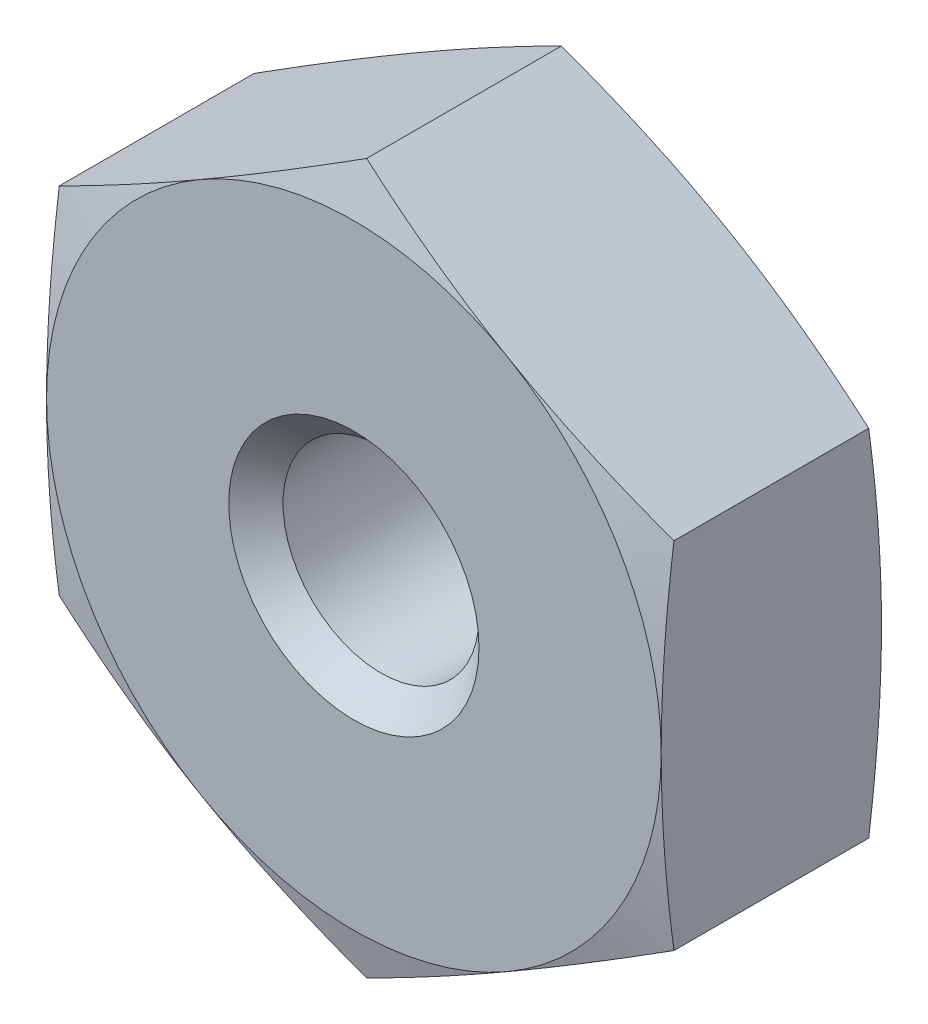
ISO-10303-21;
HEADER;
FILE_DESCRIPTION(('STEP AP214'),'2;1');
FILE_NAME('part.step','',(''),(''),'','','');
FILE_SCHEMA(('AUTOMOTIVE_DESIGN { 1 0 10303 214 1 1 1 1 }'));
ENDSEC;
DATA;
#1=APPLICATION_CONTEXT('core data for automotive mechanical design processes');
#2=APPLICATION_PROTOCOL_DEFINITION('international standard','automotive_design',2000,#1);
#3=PRODUCT_CONTEXT('',#1,'mechanical');
#4=PRODUCT('Part','Part','',(#3));
#5=PRODUCT_RELATED_PRODUCT_CATEGORY('part','',(#4));
#6=PRODUCT_DEFINITION_FORMATION('','',#4);
#7=PRODUCT_DEFINITION_CONTEXT('part definition',#1,'design');
#8=PRODUCT_DEFINITION('design','',#6,#7);
#9=PRODUCT_DEFINITION_SHAPE('','',#8);
#10=(LENGTH_UNIT() NAMED_UNIT(*) SI_UNIT(.MILLI.,.METRE.));
#11=(NAMED_UNIT(*) PLANE_ANGLE_UNIT() SI_UNIT($,.RADIAN.));
#12=(NAMED_UNIT(*) SI_UNIT($,.STERADIAN.) SOLID_ANGLE_UNIT());
#13=UNCERTAINTY_MEASURE_WITH_UNIT(LENGTH_MEASURE(1.E-05),#10,'distance_accuracy_value','');
#14=(GEOMETRIC_REPRESENTATION_CONTEXT(3) GLOBAL_UNCERTAINTY_ASSIGNED_CONTEXT((#13)) GLOBAL_UNIT_ASSIGNED_CONTEXT((#10,
#11,#12)) REPRESENTATION_CONTEXT('',''));
#15=CARTESIAN_POINT('',(0.,0.,0.));
#16=DIRECTION('',(0.,0.,1.));
#17=DIRECTION('',(1.,0.,0.));
#18=AXIS2_PLACEMENT_3D('',#15,#16,#17);
#19=CARTESIAN_POINT('',(0.,0.,-0.20894142127394));
#20=DIRECTION('',(0.,0.,-1.));
#21=DIRECTION('',(-1.,0.,0.));
#22=AXIS2_PLACEMENT_3D('',#19,#20,#21);
#23=CONICAL_SURFACE('',#22,4.67868,1.30899693899575);
#24=CARTESIAN_POINT('',(-3.8989,-5.9548079405875,-0.862465553282266));
#25=CARTESIAN_POINT('',(-3.8989,-5.77792600491228,-0.822824099629141));
#26=CARTESIAN_POINT('',(-3.8989,-5.60093350652601,-0.783667498236566));
#27=CARTESIAN_POINT('',(-3.8989,-5.24667290771525,-0.706585620527994));
#28=CARTESIAN_POINT('',(-3.8989,-5.06940479573332,-0.668660397391602));
#29=CARTESIAN_POINT('',(-3.8989,-4.71437969749929,-0.5942698928927));
#30=CARTESIAN_POINT('',(-3.8989,-4.53662240226472,-0.557806080151677));
#31=CARTESIAN_POINT('',(-3.8989,-4.18073839897813,-0.486732341183902));
#32=CARTESIAN_POINT('',(-3.8989,-4.00261169405706,-0.452122399310763));
#33=CARTESIAN_POINT('',(-3.8989,-3.64734641030079,-0.385463921286479));
#34=CARTESIAN_POINT('',(-3.8989,-3.4702112884247,-0.353397150148273));
#35=CARTESIAN_POINT('',(-3.8989,-3.11545778337327,-0.292065621097836));
#36=CARTESIAN_POINT('',(-3.8989,-2.93783938909587,-0.262800928125383));
#37=CARTESIAN_POINT('',(-3.8989,-2.40420723107434,-0.180179500201143));
#38=CARTESIAN_POINT('',(-3.8989,-2.047340277104,-0.131980573461395));
#39=CARTESIAN_POINT('',(-3.8989,-1.50838499405898,-0.0745760228997368));
#40=CARTESIAN_POINT('',(-3.8989,-1.32709298252784,-0.05787233987332));
#41=CARTESIAN_POINT('',(-3.8989,-0.964050241268872,-0.0304501651045569));
#42=CARTESIAN_POINT('',(-3.8989,-0.782299522157097,-0.0197315361006837));
#43=CARTESIAN_POINT('',(-3.8989,-0.41860673891543,-0.00490139258269939));
#44=CARTESIAN_POINT('',(-3.8989,-0.236664799393534,-0.000786875547373777));
#45=CARTESIAN_POINT('',(-3.8989,0.127245448041814,0.00058118361415337));
#46=CARTESIAN_POINT('',(-3.8989,0.309213755932402,-0.00216526834534959));
#47=CARTESIAN_POINT('',(-3.8989,0.673582988852978,-0.0143643578927159));
#48=CARTESIAN_POINT('',(-3.8989,0.855983082227824,-0.0238413349009447));
#49=CARTESIAN_POINT('',(-3.8989,1.22035421402287,-0.048960977960995));
#50=CARTESIAN_POINT('',(-3.8989,1.4023252428543,-0.064603780517835));
#51=CARTESIAN_POINT('',(-3.8989,1.76583720552235,-0.10126338842242));
#52=CARTESIAN_POINT('',(-3.8989,1.94737778034547,-0.12228370087159));
#53=CARTESIAN_POINT('',(-3.8989,2.30987318583118,-0.168829285549951));
#54=CARTESIAN_POINT('',(-3.8989,2.49082801465294,-0.194354571923017));
#55=CARTESIAN_POINT('',(-3.8989,3.00891943620135,-0.272807397929878));
#56=CARTESIAN_POINT('',(-3.8989,3.3453618661737,-0.330296840784391));
#57=CARTESIAN_POINT('',(-3.8989,4.01667989159865,-0.453790674298086));
#58=CARTESIAN_POINT('',(-3.8989,4.35155528278298,-0.519796144676224));
#59=CARTESIAN_POINT('',(-3.8989,5.02020416752271,-0.657523956803265));
#60=CARTESIAN_POINT('',(-3.8989,5.35397737384171,-0.729247682511173));
#61=CARTESIAN_POINT('',(-3.8989,6.02063682300936,-0.876585120595329));
#62=CARTESIAN_POINT('',(-3.8989,6.3535231165463,-0.952198605423072));
#63=CARTESIAN_POINT('',(-3.8989,7.01539261583675,-1.10540272548398));
#64=CARTESIAN_POINT('',(-3.8989,7.34438203181932,-1.18296663109669));
#65=CARTESIAN_POINT('',(-3.8989,8.00190194134183,-1.34003678660127));
#66=CARTESIAN_POINT('',(-3.8989,8.33043242640582,-1.41954307187825));
#67=CARTESIAN_POINT('',(-3.8989,8.98673694432565,-1.57989128294628));
#68=CARTESIAN_POINT('',(-3.8989,9.31451141037006,-1.6607314394407));
#69=CARTESIAN_POINT('',(-3.8989,9.96977483056025,-1.8235156062367));
#70=CARTESIAN_POINT('',(-3.8989,10.2972637937712,-1.90545958002187));
#71=CARTESIAN_POINT('',(-3.8989,10.6246532556475,-1.9877945230637));
#72=B_SPLINE_CURVE_WITH_KNOTS('',3,(#24,#25,#26,#27,#28,#29,#30,#31,#32,#33,#34,#35,#36,#37,#38,
#39,#40,#41,#42,#43,#44,#45,#46,#47,#48,#49,#50,#51,#52,#53,#54,#55,#56,#57,#58,#59,#60,#61,#62,
#63,#64,#65,#66,#67,#68,#69,#70,#71),.UNSPECIFIED.,.F.,.F.,(4,2,2,2,2,2,2,2,2,2,2,2,2,2,2,2,2,2,
2,2,2,2,2,4),(0.,0.543810826349206,1.08764510713402,1.63201286129449,2.17637602034992,
2.71639544743263,3.25642738674969,4.33625842182112,4.88235809136342,5.42844523611426,
5.97428403511417,6.52012236359004,7.0679447103113,7.6157791859356,8.16397186285628,
8.71216626092067,9.73593026310578,10.7598241927296,11.7839666866571,12.8080493368611,
13.8220688666467,14.8361068830233,15.8488935449974,16.8616467839258),.UNSPECIFIED.);
#73=CARTESIAN_POINT('',(-3.8989,-2.2510309645434,-0.161616751804018));
#74=VERTEX_POINT('',#73);
#75=CARTESIAN_POINT('',(-3.8989,0.,0.));
#76=VERTEX_POINT('',#75);
#77=EDGE_CURVE('E280',#74,#76,#72,.T.);
#78=ORIENTED_EDGE('',*,*,#77,.F.);
#79=CARTESIAN_POINT('',(0.000199999999999892,-4.50217739914074,-0.161647693102017));
#80=CARTESIAN_POINT('',(-0.161728081994073,-4.4086881774121,-0.136585929385571));
#81=CARTESIAN_POINT('',(-0.32394977237084,-4.31502944080467,-0.113833920488066));
#82=CARTESIAN_POINT('',(-0.648966092956606,-4.12738118062345,-0.0738606985096147));
#83=CARTESIAN_POINT('',(-0.811760928848432,-4.03339153829862,-0.0566417322831541));
#84=CARTESIAN_POINT('',(-1.13693644035193,-3.8456513691982,-0.0287398953954865));
#85=CARTESIAN_POINT('',(-1.2993149167801,-3.75190211212179,-0.0180237482063771));
#86=CARTESIAN_POINT('',(-1.62427895958489,-3.56428403453149,-0.00365448388290617));
#87=CARTESIAN_POINT('',(-1.78686447979244,-3.47041524067332,0.));
#88=CARTESIAN_POINT('',(-2.11203552020756,-3.28267765295698,0.));
#89=CARTESIAN_POINT('',(-2.27462104041511,-3.18880885909881,-0.00365448388290363));
#90=CARTESIAN_POINT('',(-2.5995850832199,-3.00119078150851,-0.0180237482063718));
#91=CARTESIAN_POINT('',(-2.76196355964807,-2.9074415244321,-0.0287398953954798));
#92=CARTESIAN_POINT('',(-3.08713907115157,-2.71970135533168,-0.0566417322831451));
#93=CARTESIAN_POINT('',(-3.24993390704339,-2.62571171300685,-0.0738606985096048));
#94=CARTESIAN_POINT('',(-3.57495022762916,-2.43806345282563,-0.113833920488055));
#95=CARTESIAN_POINT('',(-3.73717191800593,-2.3444047162182,-0.136585929385558));
#96=CARTESIAN_POINT('',(-3.8991,-2.25091549448956,-0.161647693102003));
#97=B_SPLINE_CURVE_WITH_KNOTS('',3,(#79,#80,#81,#82,#83,#84,#85,#86,#87,#88,#89,#90,#91,#92,#93,
#94,#95,#96),.UNSPECIFIED.,.F.,.F.,(4,2,2,2,2,2,2,2,4),(0.,0.56598131094294,1.13219216562238,
1.6954805939894,2.25865998985973,2.82183938573005,3.38512781409707,3.95133866877651,
4.51731997971945),.UNSPECIFIED.);
#98=CARTESIAN_POINT('',(-1.94945000000005,-3.37654644681512,0.));
#99=VERTEX_POINT('',#98);
#100=EDGE_CURVE('E156',#99,#74,#97,.T.);
#101=ORIENTED_EDGE('',*,*,#100,.F.);
#102=CARTESIAN_POINT('',(0.,0.,0.));
#103=DIRECTION('',(0.,0.,1.));
#104=DIRECTION('',(1.,0.,0.));
#105=AXIS2_PLACEMENT_3D('',#102,#103,#104);
#106=CIRCLE('',#105,3.8989);
#107=EDGE_CURVE('E260',#76,#99,#106,.T.);
#108=ORIENTED_EDGE('',*,*,#107,.F.);
#109=EDGE_LOOP('',(#78,#101,#108));
#110=FACE_BOUND('',#109,.T.);
#111=ADVANCED_FACE('F37',(#110),#23,.T.);
#112=CARTESIAN_POINT('',(-3.8989,2.2510309645434,-0.161616751804018));
#113=VERTEX_POINT('',#112);
#114=EDGE_CURVE('E277',#76,#113,#72,.T.);
#115=ORIENTED_EDGE('',*,*,#114,.F.);
#116=CARTESIAN_POINT('',(-1.94945000000005,3.37654644681512,0.));
#117=VERTEX_POINT('',#116);
#118=EDGE_CURVE('E261',#117,#76,#106,.T.);
#119=ORIENTED_EDGE('',*,*,#118,.F.);
#120=CARTESIAN_POINT('',(-3.8991,2.25091549448956,-0.161647693102003));
#121=CARTESIAN_POINT('',(-3.73717191800593,2.3444047162182,-0.136585929385558));
#122=CARTESIAN_POINT('',(-3.57495022762916,2.43806345282563,-0.113833920488055));
#123=CARTESIAN_POINT('',(-3.24993390704339,2.62571171300685,-0.0738606985096049));
#124=CARTESIAN_POINT('',(-3.08713907115157,2.71970135533168,-0.0566417322831452));
#125=CARTESIAN_POINT('',(-2.76196355964807,2.9074415244321,-0.0287398953954801));
#126=CARTESIAN_POINT('',(-2.5995850832199,3.00119078150851,-0.0180237482063721));
#127=CARTESIAN_POINT('',(-2.27462104041511,3.18880885909881,-0.00365448388290389));
#128=CARTESIAN_POINT('',(-2.11203552020756,3.28267765295698,0.));
#129=CARTESIAN_POINT('',(-1.78686447979244,3.47041524067332,0.));
#130=CARTESIAN_POINT('',(-1.62427895958489,3.56428403453149,-0.00365448388290644));
#131=CARTESIAN_POINT('',(-1.2993149167801,3.75190211212179,-0.0180237482063773));
#132=CARTESIAN_POINT('',(-1.13693644035193,3.8456513691982,-0.0287398953954866));
#133=CARTESIAN_POINT('',(-0.811760928848433,4.03339153829862,-0.0566417322831541));
#134=CARTESIAN_POINT('',(-0.648966092956607,4.12738118062345,-0.0738606985096148));
#135=CARTESIAN_POINT('',(-0.323949772370841,4.31502944080467,-0.113833920488067));
#136=CARTESIAN_POINT('',(-0.161728081994074,4.4086881774121,-0.136585929385571));
#137=CARTESIAN_POINT('',(0.000199999999999698,4.50217739914074,-0.161647693102017));
#138=B_SPLINE_CURVE_WITH_KNOTS('',3,(#120,#121,#122,#123,#124,#125,#126,#127,#128,#129,#130,
#131,#132,#133,#134,#135,#136,#137),.UNSPECIFIED.,.F.,.F.,(4,2,2,2,2,2,2,2,4),(0.,
0.56598131094294,1.13219216562238,1.6954805939894,2.25865998985973,2.82183938573005,
3.38512781409707,3.95133866877651,4.51731997971945),.UNSPECIFIED.);
#139=EDGE_CURVE('E272',#113,#117,#138,.T.);
#140=ORIENTED_EDGE('',*,*,#139,.F.);
#141=EDGE_LOOP('',(#115,#119,#140));
#142=FACE_BOUND('',#141,.T.);
#143=ADVANCED_FACE('F226',(#142),#23,.T.);
#144=CARTESIAN_POINT('',(0.,4.5020619290869,-0.161616751804032));
#145=VERTEX_POINT('',#144);
#146=EDGE_CURVE('E269',#117,#145,#138,.T.);
#147=ORIENTED_EDGE('',*,*,#146,.F.);
#148=CARTESIAN_POINT('',(1.94945000000004,3.37654644681512,0.));
#149=VERTEX_POINT('',#148);
#150=EDGE_CURVE('E45',#149,#117,#106,.T.);
#151=ORIENTED_EDGE('',*,*,#150,.F.);
#152=CARTESIAN_POINT('',(-0.000199999999999892,4.50217739914074,-0.161647693102017));
#153=CARTESIAN_POINT('',(0.161728081994073,4.4086881774121,-0.136585929385571));
#154=CARTESIAN_POINT('',(0.32394977237084,4.31502944080467,-0.113833920488066));
#155=CARTESIAN_POINT('',(0.648966092956606,4.12738118062345,-0.0738606985096147));
#156=CARTESIAN_POINT('',(0.811760928848432,4.03339153829862,-0.0566417322831541));
#157=CARTESIAN_POINT('',(1.13693644035193,3.8456513691982,-0.0287398953954865));
#158=CARTESIAN_POINT('',(1.2993149167801,3.75190211212179,-0.0180237482063771));
#159=CARTESIAN_POINT('',(1.62427895958489,3.56428403453149,-0.00365448388290617));
#160=CARTESIAN_POINT('',(1.78686447979244,3.47041524067332,0.));
#161=CARTESIAN_POINT('',(2.11203552020756,3.28267765295698,0.));
#162=CARTESIAN_POINT('',(2.27462104041511,3.18880885909881,-0.00365448388290363));
#163=CARTESIAN_POINT('',(2.5995850832199,3.00119078150851,-0.0180237482063718));
#164=CARTESIAN_POINT('',(2.76196355964807,2.9074415244321,-0.0287398953954798));
#165=CARTESIAN_POINT('',(3.08713907115157,2.71970135533168,-0.0566417322831451));
#166=CARTESIAN_POINT('',(3.24993390704339,2.62571171300685,-0.0738606985096048));
#167=CARTESIAN_POINT('',(3.57495022762916,2.43806345282563,-0.113833920488055));
#168=CARTESIAN_POINT('',(3.73717191800593,2.3444047162182,-0.136585929385558));
#169=CARTESIAN_POINT('',(3.8991,2.25091549448956,-0.161647693102003));
#170=B_SPLINE_CURVE_WITH_KNOTS('',3,(#152,#153,#154,#155,#156,#157,#158,#159,#160,#161,#162,
#163,#164,#165,#166,#167,#168,#169),.UNSPECIFIED.,.F.,.F.,(4,2,2,2,2,2,2,2,4),(0.,
0.56598131094294,1.13219216562238,1.6954805939894,2.25865998985973,2.82183938573005,
3.38512781409707,3.95133866877651,4.51731997971945),.UNSPECIFIED.);
#171=EDGE_CURVE('E268',#145,#149,#170,.T.);
#172=ORIENTED_EDGE('',*,*,#171,.F.);
#173=EDGE_LOOP('',(#147,#151,#172));
#174=FACE_BOUND('',#173,.T.);
#175=ADVANCED_FACE('F232',(#174),#23,.T.);
#176=CARTESIAN_POINT('',(3.8989,2.2510309645434,-0.161616751804018));
#177=VERTEX_POINT('',#176);
#178=EDGE_CURVE('E330',#149,#177,#170,.T.);
#179=ORIENTED_EDGE('',*,*,#178,.F.);
#180=CARTESIAN_POINT('',(3.8989,0.,0.));
#181=VERTEX_POINT('',#180);
#182=EDGE_CURVE('E11',#181,#149,#106,.T.);
#183=ORIENTED_EDGE('',*,*,#182,.F.);
#184=CARTESIAN_POINT('',(3.8989,-5.9548079405875,-0.862465553282266));
#185=CARTESIAN_POINT('',(3.8989,-5.77792600491228,-0.822824099629141));
#186=CARTESIAN_POINT('',(3.8989,-5.60093350652601,-0.783667498236566));
#187=CARTESIAN_POINT('',(3.8989,-5.24667290771525,-0.706585620527994));
#188=CARTESIAN_POINT('',(3.8989,-5.06940479573332,-0.668660397391602));
#189=CARTESIAN_POINT('',(3.8989,-4.71437969749929,-0.5942698928927));
#190=CARTESIAN_POINT('',(3.8989,-4.53662240226472,-0.557806080151677));
#191=CARTESIAN_POINT('',(3.8989,-4.18073839897813,-0.486732341183902));
#192=CARTESIAN_POINT('',(3.8989,-4.00261169405706,-0.452122399310763));
#193=CARTESIAN_POINT('',(3.8989,-3.64734641030079,-0.385463921286479));
#194=CARTESIAN_POINT('',(3.8989,-3.4702112884247,-0.353397150148273));
#195=CARTESIAN_POINT('',(3.8989,-3.11545778337327,-0.292065621097836));
#196=CARTESIAN_POINT('',(3.8989,-2.93783938909587,-0.262800928125383));
#197=CARTESIAN_POINT('',(3.8989,-2.40420723107434,-0.180179500201143));
#198=CARTESIAN_POINT('',(3.8989,-2.047340277104,-0.131980573461395));
#199=CARTESIAN_POINT('',(3.8989,-1.50838499405898,-0.0745760228997368));
#200=CARTESIAN_POINT('',(3.8989,-1.32709298252784,-0.05787233987332));
#201=CARTESIAN_POINT('',(3.8989,-0.964050241268872,-0.0304501651045569));
#202=CARTESIAN_POINT('',(3.8989,-0.782299522157097,-0.0197315361006837));
#203=CARTESIAN_POINT('',(3.8989,-0.41860673891543,-0.00490139258269939));
#204=CARTESIAN_POINT('',(3.8989,-0.236664799393534,-0.000786875547373777));
#205=CARTESIAN_POINT('',(3.8989,0.127245448041814,0.00058118361415337));
#206=CARTESIAN_POINT('',(3.8989,0.309213755932402,-0.00216526834534959));
#207=CARTESIAN_POINT('',(3.8989,0.673582988852978,-0.0143643578927159));
#208=CARTESIAN_POINT('',(3.8989,0.855983082227824,-0.0238413349009447));
#209=CARTESIAN_POINT('',(3.8989,1.22035421402287,-0.048960977960995));
#210=CARTESIAN_POINT('',(3.8989,1.4023252428543,-0.064603780517835));
#211=CARTESIAN_POINT('',(3.8989,1.76583720552235,-0.10126338842242));
#212=CARTESIAN_POINT('',(3.8989,1.94737778034547,-0.12228370087159));
#213=CARTESIAN_POINT('',(3.8989,2.30987318583118,-0.168829285549951));
#214=CARTESIAN_POINT('',(3.8989,2.49082801465294,-0.194354571923017));
#215=CARTESIAN_POINT('',(3.8989,3.00891943620135,-0.272807397929878));
#216=CARTESIAN_POINT('',(3.8989,3.3453618661737,-0.330296840784391));
#217=CARTESIAN_POINT('',(3.8989,4.01667989159865,-0.453790674298086));
#218=CARTESIAN_POINT('',(3.8989,4.35155528278298,-0.519796144676224));
#219=CARTESIAN_POINT('',(3.8989,5.02020416752271,-0.657523956803265));
#220=CARTESIAN_POINT('',(3.8989,5.35397737384171,-0.729247682511173));
#221=CARTESIAN_POINT('',(3.8989,6.02063682300936,-0.876585120595329));
#222=CARTESIAN_POINT('',(3.8989,6.3535231165463,-0.952198605423072));
#223=CARTESIAN_POINT('',(3.8989,7.01539261583675,-1.10540272548398));
#224=CARTESIAN_POINT('',(3.8989,7.34438203181932,-1.18296663109669));
#225=CARTESIAN_POINT('',(3.8989,8.00190194134183,-1.34003678660127));
#226=CARTESIAN_POINT('',(3.8989,8.33043242640582,-1.41954307187825));
#227=CARTESIAN_POINT('',(3.8989,8.98673694432565,-1.57989128294628));
#228=CARTESIAN_POINT('',(3.8989,9.31451141037006,-1.6607314394407));
#229=CARTESIAN_POINT('',(3.8989,9.96977483056025,-1.8235156062367));
#230=CARTESIAN_POINT('',(3.8989,10.2972637937712,-1.90545958002187));
#231=CARTESIAN_POINT('',(3.8989,10.6246532556475,-1.9877945230637));
#232=B_SPLINE_CURVE_WITH_KNOTS('',3,(#184,#185,#186,#187,#188,#189,#190,#191,#192,#193,#194,
#195,#196,#197,#198,#199,#200,#201,#202,#203,#204,#205,#206,#207,#208,#209,#210,#211,#212,#213,
#214,#215,#216,#217,#218,#219,#220,#221,#222,#223,#224,#225,#226,#227,#228,#229,#230,#231),
.UNSPECIFIED.,.F.,.F.,(4,2,2,2,2,2,2,2,2,2,2,2,2,2,2,2,2,2,2,2,2,2,2,4),(0.,0.543810826349206,
1.08764510713402,1.63201286129449,2.17637602034992,2.71639544743263,3.25642738674969,
4.33625842182112,4.88235809136342,5.42844523611426,5.97428403511417,6.52012236359004,
7.0679447103113,7.6157791859356,8.16397186285628,8.71216626092067,9.73593026310578,
10.7598241927296,11.7839666866571,12.8080493368611,13.8220688666467,14.8361068830233,
15.8488935449974,16.8616467839258),.UNSPECIFIED.);
#233=EDGE_CURVE('E328',#177,#181,#232,.F.);
#234=ORIENTED_EDGE('',*,*,#233,.F.);
#235=EDGE_LOOP('',(#179,#183,#234));
#236=FACE_BOUND('',#235,.T.);
#237=ADVANCED_FACE('F244',(#236),#23,.T.);
#238=CARTESIAN_POINT('',(3.8989,-2.2510309645434,-0.161616751804018));
#239=VERTEX_POINT('',#238);
#240=EDGE_CURVE('E254',#181,#239,#232,.F.);
#241=ORIENTED_EDGE('',*,*,#240,.F.);
#242=CARTESIAN_POINT('',(1.94945000000005,-3.37654644681512,0.));
#243=VERTEX_POINT('',#242);
#244=EDGE_CURVE('E46',#243,#181,#106,.T.);
#245=ORIENTED_EDGE('',*,*,#244,.F.);
#246=CARTESIAN_POINT('',(3.8991,-2.25091549448956,-0.161647693102003));
#247=CARTESIAN_POINT('',(3.73717191800593,-2.3444047162182,-0.136585929385558));
#248=CARTESIAN_POINT('',(3.57495022762916,-2.43806345282563,-0.113833920488055));
#249=CARTESIAN_POINT('',(3.24993390704339,-2.62571171300685,-0.0738606985096049));
#250=CARTESIAN_POINT('',(3.08713907115157,-2.71970135533168,-0.0566417322831452));
#251=CARTESIAN_POINT('',(2.76196355964807,-2.9074415244321,-0.0287398953954801));
#252=CARTESIAN_POINT('',(2.5995850832199,-3.00119078150851,-0.0180237482063721));
#253=CARTESIAN_POINT('',(2.27462104041511,-3.18880885909881,-0.00365448388290389));
#254=CARTESIAN_POINT('',(2.11203552020756,-3.28267765295698,0.));
#255=CARTESIAN_POINT('',(1.78686447979244,-3.47041524067332,0.));
#256=CARTESIAN_POINT('',(1.62427895958489,-3.56428403453149,-0.00365448388290644));
#257=CARTESIAN_POINT('',(1.2993149167801,-3.75190211212179,-0.0180237482063773));
#258=CARTESIAN_POINT('',(1.13693644035193,-3.8456513691982,-0.0287398953954866));
#259=CARTESIAN_POINT('',(0.811760928848433,-4.03339153829862,-0.0566417322831541));
#260=CARTESIAN_POINT('',(0.648966092956607,-4.12738118062345,-0.0738606985096148));
#261=CARTESIAN_POINT('',(0.323949772370841,-4.31502944080467,-0.113833920488067));
#262=CARTESIAN_POINT('',(0.161728081994074,-4.4086881774121,-0.136585929385571));
#263=CARTESIAN_POINT('',(-0.000199999999999698,-4.50217739914074,-0.161647693102017));
#264=B_SPLINE_CURVE_WITH_KNOTS('',3,(#246,#247,#248,#249,#250,#251,#252,#253,#254,#255,#256,
#257,#258,#259,#260,#261,#262,#263),.UNSPECIFIED.,.F.,.F.,(4,2,2,2,2,2,2,2,4),(0.,
0.56598131094294,1.13219216562238,1.6954805939894,2.25865998985973,2.82183938573005,
3.38512781409707,3.95133866877651,4.51731997971945),.UNSPECIFIED.);
#265=EDGE_CURVE('E148',#239,#243,#264,.T.);
#266=ORIENTED_EDGE('',*,*,#265,.F.);
#267=EDGE_LOOP('',(#241,#245,#266));
#268=FACE_BOUND('',#267,.T.);
#269=ADVANCED_FACE('F237',(#268),#23,.T.);
#270=CARTESIAN_POINT('',(0.,-4.5020619290869,-0.161616751804032));
#271=VERTEX_POINT('',#270);
#272=EDGE_CURVE('E140',#243,#271,#264,.T.);
#273=ORIENTED_EDGE('',*,*,#272,.F.);
#274=EDGE_CURVE('E249',#99,#243,#106,.T.);
#275=ORIENTED_EDGE('',*,*,#274,.F.);
#276=EDGE_CURVE('E53',#271,#99,#97,.T.);
#277=ORIENTED_EDGE('',*,*,#276,.F.);
#278=EDGE_LOOP('',(#273,#275,#277));
#279=FACE_BOUND('',#278,.T.);
#280=ADVANCED_FACE('F228',(#279),#23,.T.);
#281=CARTESIAN_POINT('',(0.,0.,0.));
#282=DIRECTION('',(0.,0.,-1.));
#283=DIRECTION('',(-1.,0.,0.));
#284=AXIS2_PLACEMENT_3D('',#281,#282,#283);
#285=PLANE('',#284);
#286=CARTESIAN_POINT('',(0.,0.,0.));
#287=DIRECTION('',(0.,0.,1.));
#288=DIRECTION('',(1.,0.,0.));
#289=AXIS2_PLACEMENT_3D('',#286,#287,#288);
#290=CIRCLE('',#289,1.5875);
#291=CARTESIAN_POINT('',(1.5875,0.,0.));
#292=VERTEX_POINT('',#291);
#293=EDGE_CURVE('E187',#292,#292,#290,.T.);
#294=ORIENTED_EDGE('',*,*,#293,.F.);
#295=EDGE_LOOP('',(#294));
#296=FACE_BOUND('',#295,.T.);
#297=ORIENTED_EDGE('',*,*,#182,.T.);
#298=ORIENTED_EDGE('',*,*,#150,.T.);
#299=ORIENTED_EDGE('',*,*,#118,.T.);
#300=ORIENTED_EDGE('',*,*,#107,.T.);
#301=ORIENTED_EDGE('',*,*,#274,.T.);
#302=ORIENTED_EDGE('',*,*,#244,.T.);
#303=EDGE_LOOP('',(#297,#298,#299,#300,#301,#302));
#304=FACE_BOUND('',#303,.T.);
#305=ADVANCED_FACE('F39',(#296,#304),#285,.F.);
#306=CARTESIAN_POINT('',(-3.8989,2.2510309645434,-2.794));
#307=DIRECTION('',(-1.,0.,0.));
#308=DIRECTION('',(0.,0.,1.));
#309=AXIS2_PLACEMENT_3D('',#306,#307,#308);
#310=PLANE('',#309);
#311=ORIENTED_EDGE('',*,*,#77,.T.);
#312=ORIENTED_EDGE('',*,*,#114,.T.);
#313=DIRECTION('',(0.,0.,1.));
#314=VECTOR('',#313,1.);
#315=CARTESIAN_POINT('',(-3.8989,2.2510309645434,-2.794));
#316=LINE('',#315,#314);
#317=CARTESIAN_POINT('',(-3.8989,2.2510309645434,-2.63238324819601));
#318=VERTEX_POINT('',#317);
#319=EDGE_CURVE('E133',#318,#113,#316,.T.);
#320=ORIENTED_EDGE('',*,*,#319,.F.);
#321=CARTESIAN_POINT('',(-3.8989,-5.9548079405875,-1.9315344467179));
#322=CARTESIAN_POINT('',(-3.8989,-5.77792600491227,-1.97117590037102));
#323=CARTESIAN_POINT('',(-3.8989,-5.60093350652601,-2.01033250176359));
#324=CARTESIAN_POINT('',(-3.8989,-5.24667290771524,-2.08741437947214));
#325=CARTESIAN_POINT('',(-3.8989,-5.06940479573332,-2.12533960260853));
#326=CARTESIAN_POINT('',(-3.8989,-4.71437969749929,-2.19973010710741));
#327=CARTESIAN_POINT('',(-3.8989,-4.53662240226472,-2.23619391984843));
#328=CARTESIAN_POINT('',(-3.8989,-4.18073839897813,-2.30726765881619));
#329=CARTESIAN_POINT('',(-3.8989,-4.00261169405705,-2.34187760068932));
#330=CARTESIAN_POINT('',(-3.8989,-3.64734641030078,-2.4085360787136));
#331=CARTESIAN_POINT('',(-3.8989,-3.4702112884247,-2.44060284985179));
#332=CARTESIAN_POINT('',(-3.8989,-3.11545778337326,-2.50193437890222));
#333=CARTESIAN_POINT('',(-3.8989,-2.93783938909586,-2.53119907187467));
#334=CARTESIAN_POINT('',(-3.8989,-2.40420723107434,-2.61382049979889));
#335=CARTESIAN_POINT('',(-3.8989,-2.047340277104,-2.66201942653863));
#336=CARTESIAN_POINT('',(-3.8989,-1.50838499405898,-2.71942397710028));
#337=CARTESIAN_POINT('',(-3.8989,-1.32709298252784,-2.73612766012669));
#338=CARTESIAN_POINT('',(-3.8989,-0.964050241268875,-2.76354983489545));
#339=CARTESIAN_POINT('',(-3.8989,-0.782299522157103,-2.77426846389932));
#340=CARTESIAN_POINT('',(-3.8989,-0.41860673891544,-2.7890986074173));
#341=CARTESIAN_POINT('',(-3.8989,-0.236664799393546,-2.79321312445263));
#342=CARTESIAN_POINT('',(-3.8989,0.127245448041799,-2.79458118361415));
#343=CARTESIAN_POINT('',(-3.8989,0.309213755932385,-2.79183473165465));
#344=CARTESIAN_POINT('',(-3.8989,0.673582988852957,-2.77963564210729));
#345=CARTESIAN_POINT('',(-3.8989,0.855983082227801,-2.77015866509906));
#346=CARTESIAN_POINT('',(-3.8989,1.22035421402285,-2.74503902203902));
#347=CARTESIAN_POINT('',(-3.8989,1.40232524285427,-2.72939621948218));
#348=CARTESIAN_POINT('',(-3.8989,1.76583720552232,-2.6927366115776));
#349=CARTESIAN_POINT('',(-3.8989,1.94737778034544,-2.67171629912844));
#350=CARTESIAN_POINT('',(-3.8989,2.30987318583115,-2.62517071445009));
#351=CARTESIAN_POINT('',(-3.8989,2.4908280146529,-2.59964542807703));
#352=CARTESIAN_POINT('',(-3.8989,3.0089194362013,-2.52119260207018));
#353=CARTESIAN_POINT('',(-3.8989,3.34536186617366,-2.46370315921568));
#354=CARTESIAN_POINT('',(-3.8989,4.01667989159861,-2.34020932570201));
#355=CARTESIAN_POINT('',(-3.8989,4.35155528278294,-2.27420385532388));
#356=CARTESIAN_POINT('',(-3.8989,5.02020416752267,-2.13647604319687));
#357=CARTESIAN_POINT('',(-3.8989,5.35397737384168,-2.06475231748897));
#358=CARTESIAN_POINT('',(-3.8989,6.02063682300933,-1.91741487940485));
#359=CARTESIAN_POINT('',(-3.8989,6.35352311654627,-1.84180139457712));
#360=CARTESIAN_POINT('',(-3.8989,7.01539261583673,-1.68859727451624));
#361=CARTESIAN_POINT('',(-3.8989,7.3443820318193,-1.61103336890355));
#362=CARTESIAN_POINT('',(-3.8989,8.00190194134182,-1.45396321339899));
#363=CARTESIAN_POINT('',(-3.8989,8.3304324264058,-1.37445692812203));
#364=CARTESIAN_POINT('',(-3.8989,8.98673694432564,-1.21410871705402));
#365=CARTESIAN_POINT('',(-3.8989,9.31451141037006,-1.13326856055962));
#366=CARTESIAN_POINT('',(-3.8989,9.96977483056026,-0.970484393763651));
#367=CARTESIAN_POINT('',(-3.8989,10.2972637937713,-0.888540419978488));
#368=CARTESIAN_POINT('',(-3.8989,10.6246532556475,-0.80620547693667));
#369=B_SPLINE_CURVE_WITH_KNOTS('',3,(#321,#322,#323,#324,#325,#326,#327,#328,#329,#330,#331,
#332,#333,#334,#335,#336,#337,#338,#339,#340,#341,#342,#343,#344,#345,#346,#347,#348,#349,#350,
#351,#352,#353,#354,#355,#356,#357,#358,#359,#360,#361,#362,#363,#364,#365,#366,#367,#368),
.UNSPECIFIED.,.F.,.F.,(4,2,2,2,2,2,2,2,2,2,2,2,2,2,2,2,2,2,2,2,2,2,2,4),(0.,0.543810826349202,
1.08764510713401,1.63201286129447,2.1763760203499,2.71639544743261,3.25642738674967,
4.33625842182109,4.88235809136339,5.42844523611422,5.97428403511412,6.52012236358999,
7.06794471031124,7.61577918593553,8.16397186285621,8.71216626092059,9.7359302631057,
10.7598241927295,11.783966686657,12.808049336861,13.8220688666466,14.8361068830232,
15.8488935449973,16.8616467839257),.UNSPECIFIED.);
#370=CARTESIAN_POINT('',(-3.8989,0.,-2.794));
#371=VERTEX_POINT('',#370);
#372=EDGE_CURVE('E281',#318,#371,#369,.F.);
#373=ORIENTED_EDGE('',*,*,#372,.T.);
#374=CARTESIAN_POINT('',(-3.8989,-2.2510309645434,-2.63238324819601));
#375=VERTEX_POINT('',#374);
#376=EDGE_CURVE('E284',#371,#375,#369,.F.);
#377=ORIENTED_EDGE('',*,*,#376,.T.);
#378=DIRECTION('',(0.,0.,1.));
#379=VECTOR('',#378,1.);
#380=CARTESIAN_POINT('',(-3.8989,-2.2510309645434,-2.794));
#381=LINE('',#380,#379);
#382=EDGE_CURVE('E142',#375,#74,#381,.T.);
#383=ORIENTED_EDGE('',*,*,#382,.T.);
#384=EDGE_LOOP('',(#311,#312,#320,#373,#377,#383));
#385=FACE_BOUND('',#384,.T.);
#386=ADVANCED_FACE('F179',(#385),#310,.T.);
#387=CARTESIAN_POINT('',(0.,4.5020619290869,-2.794));
#388=DIRECTION('',(-0.500000000000011,0.866025403784432,0.));
#389=DIRECTION('',(-0.866025403784432,-0.500000000000011,0.));
#390=AXIS2_PLACEMENT_3D('',#387,#388,#389);
#391=PLANE('',#390);
#392=ORIENTED_EDGE('',*,*,#139,.T.);
#393=ORIENTED_EDGE('',*,*,#146,.T.);
#394=DIRECTION('',(0.,0.,1.));
#395=VECTOR('',#394,1.);
#396=CARTESIAN_POINT('',(0.,4.5020619290869,-2.794));
#397=LINE('',#396,#395);
#398=CARTESIAN_POINT('',(0.,4.5020619290869,-2.632383248196));
#399=VERTEX_POINT('',#398);
#400=EDGE_CURVE('E194',#399,#145,#397,.T.);
#401=ORIENTED_EDGE('',*,*,#400,.F.);
#402=CARTESIAN_POINT('',(0.000200000000000037,4.50217739914074,-2.63235230689801));
#403=CARTESIAN_POINT('',(-0.161728081994074,4.4086881774121,-2.65741407061446));
#404=CARTESIAN_POINT('',(-0.323949772370841,4.31502944080467,-2.68016607951196));
#405=CARTESIAN_POINT('',(-0.648966092956606,4.12738118062345,-2.7201393014904));
#406=CARTESIAN_POINT('',(-0.811760928848432,4.03339153829862,-2.73735826771686));
#407=CARTESIAN_POINT('',(-1.13693644035193,3.8456513691982,-2.76526010460452));
#408=CARTESIAN_POINT('',(-1.2993149167801,3.75190211212179,-2.77597625179363));
#409=CARTESIAN_POINT('',(-1.62427895958489,3.56428403453149,-2.79034551611709));
#410=CARTESIAN_POINT('',(-1.78686447979244,3.47041524067332,-2.794));
#411=CARTESIAN_POINT('',(-2.11203552020756,3.28267765295698,-2.794));
#412=CARTESIAN_POINT('',(-2.27462104041511,3.18880885909881,-2.7903455161171));
#413=CARTESIAN_POINT('',(-2.5995850832199,3.00119078150851,-2.77597625179363));
#414=CARTESIAN_POINT('',(-2.76196355964807,2.9074415244321,-2.76526010460453));
#415=CARTESIAN_POINT('',(-3.08713907115157,2.71970135533168,-2.73735826771687));
#416=CARTESIAN_POINT('',(-3.24993390704339,2.62571171300685,-2.72013930149041));
#417=CARTESIAN_POINT('',(-3.57495022762916,2.43806345282563,-2.68016607951197));
#418=CARTESIAN_POINT('',(-3.73717191800593,2.3444047162182,-2.65741407061447));
#419=CARTESIAN_POINT('',(-3.8991,2.25091549448956,-2.63235230689803));
#420=B_SPLINE_CURVE_WITH_KNOTS('',3,(#402,#403,#404,#405,#406,#407,#408,#409,#410,#411,#412,
#413,#414,#415,#416,#417,#418,#419),.UNSPECIFIED.,.F.,.F.,(4,2,2,2,2,2,2,2,4),(0.,
0.565981310942939,1.13219216562238,1.6954805939894,2.25865998985972,2.82183938573005,
3.38512781409707,3.95133866877651,4.51731997971945),.UNSPECIFIED.);
#421=CARTESIAN_POINT('',(-1.94945000000005,3.37654644681512,-2.794));
#422=VERTEX_POINT('',#421);
#423=EDGE_CURVE('E273',#399,#422,#420,.T.);
#424=ORIENTED_EDGE('',*,*,#423,.T.);
#425=EDGE_CURVE('E320',#422,#318,#420,.T.);
#426=ORIENTED_EDGE('',*,*,#425,.T.);
#427=ORIENTED_EDGE('',*,*,#319,.T.);
#428=EDGE_LOOP('',(#392,#393,#401,#424,#426,#427));
#429=FACE_BOUND('',#428,.T.);
#430=ADVANCED_FACE('F345',(#429),#391,.T.);
#431=CARTESIAN_POINT('',(3.8989,2.2510309645434,-2.794));
#432=DIRECTION('',(0.500000000000011,0.866025403784432,0.));
#433=DIRECTION('',(-0.866025403784432,0.500000000000011,0.));
#434=AXIS2_PLACEMENT_3D('',#431,#432,#433);
#435=PLANE('',#434);
#436=ORIENTED_EDGE('',*,*,#171,.T.);
#437=ORIENTED_EDGE('',*,*,#178,.T.);
#438=DIRECTION('',(0.,0.,1.));
#439=VECTOR('',#438,1.);
#440=CARTESIAN_POINT('',(3.8989,2.2510309645434,-2.794));
#441=LINE('',#440,#439);
#442=CARTESIAN_POINT('',(3.8989,2.2510309645434,-2.63238324819601));
#443=VERTEX_POINT('',#442);
#444=EDGE_CURVE('E191',#443,#177,#441,.T.);
#445=ORIENTED_EDGE('',*,*,#444,.F.);
#446=CARTESIAN_POINT('',(3.8991,2.25091549448956,-2.63235230689803));
#447=CARTESIAN_POINT('',(3.73717191800593,2.3444047162182,-2.65741407061447));
#448=CARTESIAN_POINT('',(3.57495022762916,2.43806345282563,-2.68016607951197));
#449=CARTESIAN_POINT('',(3.24993390704339,2.62571171300685,-2.72013930149041));
#450=CARTESIAN_POINT('',(3.08713907115157,2.71970135533168,-2.73735826771687));
#451=CARTESIAN_POINT('',(2.76196355964807,2.9074415244321,-2.76526010460453));
#452=CARTESIAN_POINT('',(2.5995850832199,3.00119078150851,-2.77597625179363));
#453=CARTESIAN_POINT('',(2.27462104041511,3.18880885909881,-2.7903455161171));
#454=CARTESIAN_POINT('',(2.11203552020756,3.28267765295698,-2.794));
#455=CARTESIAN_POINT('',(1.78686447979244,3.47041524067332,-2.794));
#456=CARTESIAN_POINT('',(1.62427895958489,3.56428403453149,-2.79034551611709));
#457=CARTESIAN_POINT('',(1.2993149167801,3.75190211212179,-2.77597625179363));
#458=CARTESIAN_POINT('',(1.13693644035193,3.8456513691982,-2.76526010460452));
#459=CARTESIAN_POINT('',(0.811760928848432,4.03339153829862,-2.73735826771686));
#460=CARTESIAN_POINT('',(0.648966092956606,4.12738118062345,-2.7201393014904));
#461=CARTESIAN_POINT('',(0.323949772370841,4.31502944080467,-2.68016607951196));
#462=CARTESIAN_POINT('',(0.161728081994074,4.4086881774121,-2.65741407061446));
#463=CARTESIAN_POINT('',(-0.000200000000000048,4.50217739914074,-2.63235230689801));
#464=B_SPLINE_CURVE_WITH_KNOTS('',3,(#446,#447,#448,#449,#450,#451,#452,#453,#454,#455,#456,
#457,#458,#459,#460,#461,#462,#463),.UNSPECIFIED.,.F.,.F.,(4,2,2,2,2,2,2,2,4),(0.,
0.565981310942938,1.13219216562238,1.6954805939894,2.25865998985972,2.82183938573005,
3.38512781409707,3.95133866877651,4.51731997971945),.UNSPECIFIED.);
#465=CARTESIAN_POINT('',(1.94945000000004,3.37654644681512,-2.794));
#466=VERTEX_POINT('',#465);
#467=EDGE_CURVE('E327',#443,#466,#464,.T.);
#468=ORIENTED_EDGE('',*,*,#467,.T.);
#469=EDGE_CURVE('E325',#466,#399,#464,.T.);
#470=ORIENTED_EDGE('',*,*,#469,.T.);
#471=ORIENTED_EDGE('',*,*,#400,.T.);
#472=EDGE_LOOP('',(#436,#437,#445,#468,#470,#471));
#473=FACE_BOUND('',#472,.T.);
#474=ADVANCED_FACE('F342',(#473),#435,.T.);
#475=CARTESIAN_POINT('',(3.8989,-2.2510309645434,-2.794));
#476=DIRECTION('',(1.,0.,0.));
#477=DIRECTION('',(0.,0.,-1.));
#478=AXIS2_PLACEMENT_3D('',#475,#476,#477);
#479=PLANE('',#478);
#480=ORIENTED_EDGE('',*,*,#233,.T.);
#481=ORIENTED_EDGE('',*,*,#240,.T.);
#482=DIRECTION('',(0.,0.,1.));
#483=VECTOR('',#482,1.);
#484=CARTESIAN_POINT('',(3.8989,-2.2510309645434,-2.794));
#485=LINE('',#484,#483);
#486=CARTESIAN_POINT('',(3.8989,-2.2510309645434,-2.63238324819601));
#487=VERTEX_POINT('',#486);
#488=EDGE_CURVE('E141',#487,#239,#485,.T.);
#489=ORIENTED_EDGE('',*,*,#488,.F.);
#490=CARTESIAN_POINT('',(3.8989,-5.9548079405875,-1.9315344467179));
#491=CARTESIAN_POINT('',(3.8989,-5.77792600491227,-1.97117590037102));
#492=CARTESIAN_POINT('',(3.8989,-5.60093350652601,-2.01033250176359));
#493=CARTESIAN_POINT('',(3.8989,-5.24667290771524,-2.08741437947214));
#494=CARTESIAN_POINT('',(3.8989,-5.06940479573332,-2.12533960260853));
#495=CARTESIAN_POINT('',(3.8989,-4.71437969749929,-2.19973010710741));
#496=CARTESIAN_POINT('',(3.8989,-4.53662240226472,-2.23619391984843));
#497=CARTESIAN_POINT('',(3.8989,-4.18073839897813,-2.30726765881619));
#498=CARTESIAN_POINT('',(3.8989,-4.00261169405705,-2.34187760068932));
#499=CARTESIAN_POINT('',(3.8989,-3.64734641030078,-2.4085360787136));
#500=CARTESIAN_POINT('',(3.8989,-3.4702112884247,-2.44060284985179));
#501=CARTESIAN_POINT('',(3.8989,-3.11545778337326,-2.50193437890222));
#502=CARTESIAN_POINT('',(3.8989,-2.93783938909586,-2.53119907187467));
#503=CARTESIAN_POINT('',(3.8989,-2.40420723107434,-2.61382049979889));
#504=CARTESIAN_POINT('',(3.8989,-2.047340277104,-2.66201942653863));
#505=CARTESIAN_POINT('',(3.8989,-1.50838499405898,-2.71942397710028));
#506=CARTESIAN_POINT('',(3.8989,-1.32709298252784,-2.73612766012669));
#507=CARTESIAN_POINT('',(3.8989,-0.964050241268875,-2.76354983489545));
#508=CARTESIAN_POINT('',(3.8989,-0.782299522157103,-2.77426846389932));
#509=CARTESIAN_POINT('',(3.8989,-0.41860673891544,-2.7890986074173));
#510=CARTESIAN_POINT('',(3.8989,-0.236664799393546,-2.79321312445263));
#511=CARTESIAN_POINT('',(3.8989,0.127245448041799,-2.79458118361415));
#512=CARTESIAN_POINT('',(3.8989,0.309213755932385,-2.79183473165465));
#513=CARTESIAN_POINT('',(3.8989,0.673582988852957,-2.77963564210729));
#514=CARTESIAN_POINT('',(3.8989,0.855983082227801,-2.77015866509906));
#515=CARTESIAN_POINT('',(3.8989,1.22035421402285,-2.74503902203902));
#516=CARTESIAN_POINT('',(3.8989,1.40232524285427,-2.72939621948218));
#517=CARTESIAN_POINT('',(3.8989,1.76583720552232,-2.6927366115776));
#518=CARTESIAN_POINT('',(3.8989,1.94737778034544,-2.67171629912844));
#519=CARTESIAN_POINT('',(3.8989,2.30987318583115,-2.62517071445009));
#520=CARTESIAN_POINT('',(3.8989,2.4908280146529,-2.59964542807703));
#521=CARTESIAN_POINT('',(3.8989,3.0089194362013,-2.52119260207018));
#522=CARTESIAN_POINT('',(3.8989,3.34536186617366,-2.46370315921568));
#523=CARTESIAN_POINT('',(3.8989,4.01667989159861,-2.34020932570201));
#524=CARTESIAN_POINT('',(3.8989,4.35155528278294,-2.27420385532388));
#525=CARTESIAN_POINT('',(3.8989,5.02020416752267,-2.13647604319687));
#526=CARTESIAN_POINT('',(3.8989,5.35397737384168,-2.06475231748897));
#527=CARTESIAN_POINT('',(3.8989,6.02063682300933,-1.91741487940485));
#528=CARTESIAN_POINT('',(3.8989,6.35352311654627,-1.84180139457712));
#529=CARTESIAN_POINT('',(3.8989,7.01539261583673,-1.68859727451624));
#530=CARTESIAN_POINT('',(3.8989,7.3443820318193,-1.61103336890355));
#531=CARTESIAN_POINT('',(3.8989,8.00190194134182,-1.45396321339899));
#532=CARTESIAN_POINT('',(3.8989,8.3304324264058,-1.37445692812203));
#533=CARTESIAN_POINT('',(3.8989,8.98673694432564,-1.21410871705402));
#534=CARTESIAN_POINT('',(3.8989,9.31451141037006,-1.13326856055962));
#535=CARTESIAN_POINT('',(3.8989,9.96977483056026,-0.970484393763651));
#536=CARTESIAN_POINT('',(3.8989,10.2972637937713,-0.888540419978488));
#537=CARTESIAN_POINT('',(3.8989,10.6246532556475,-0.80620547693667));
#538=B_SPLINE_CURVE_WITH_KNOTS('',3,(#490,#491,#492,#493,#494,#495,#496,#497,#498,#499,#500,
#501,#502,#503,#504,#505,#506,#507,#508,#509,#510,#511,#512,#513,#514,#515,#516,#517,#518,#519,
#520,#521,#522,#523,#524,#525,#526,#527,#528,#529,#530,#531,#532,#533,#534,#535,#536,#537),
.UNSPECIFIED.,.F.,.F.,(4,2,2,2,2,2,2,2,2,2,2,2,2,2,2,2,2,2,2,2,2,2,2,4),(0.,0.543810826349202,
1.08764510713401,1.63201286129447,2.1763760203499,2.71639544743261,3.25642738674967,
4.33625842182109,4.88235809136339,5.42844523611422,5.97428403511412,6.52012236358999,
7.06794471031124,7.61577918593553,8.16397186285621,8.71216626092059,9.7359302631057,
10.7598241927295,11.783966686657,12.808049336861,13.8220688666466,14.8361068830232,
15.8488935449973,16.8616467839257),.UNSPECIFIED.);
#539=CARTESIAN_POINT('',(3.8989,0.,-2.794));
#540=VERTEX_POINT('',#539);
#541=EDGE_CURVE('E554',#487,#540,#538,.T.);
#542=ORIENTED_EDGE('',*,*,#541,.T.);
#543=EDGE_CURVE('E359',#540,#443,#538,.T.);
#544=ORIENTED_EDGE('',*,*,#543,.T.);
#545=ORIENTED_EDGE('',*,*,#444,.T.);
#546=EDGE_LOOP('',(#480,#481,#489,#542,#544,#545));
#547=FACE_BOUND('',#546,.T.);
#548=ADVANCED_FACE('F171',(#547),#479,.T.);
#549=CARTESIAN_POINT('',(0.,-4.5020619290869,-2.794));
#550=DIRECTION('',(0.500000000000011,-0.866025403784432,0.));
#551=DIRECTION('',(0.866025403784432,0.500000000000011,0.));
#552=AXIS2_PLACEMENT_3D('',#549,#550,#551);
#553=PLANE('',#552);
#554=ORIENTED_EDGE('',*,*,#265,.T.);
#555=ORIENTED_EDGE('',*,*,#272,.T.);
#556=DIRECTION('',(0.,0.,1.));
#557=VECTOR('',#556,1.);
#558=CARTESIAN_POINT('',(0.,-4.5020619290869,-2.794));
#559=LINE('',#558,#557);
#560=CARTESIAN_POINT('',(0.,-4.5020619290869,-2.632383248196));
#561=VERTEX_POINT('',#560);
#562=EDGE_CURVE('E128',#561,#271,#559,.T.);
#563=ORIENTED_EDGE('',*,*,#562,.F.);
#564=CARTESIAN_POINT('',(-0.000200000000000037,-4.50217739914074,-2.63235230689801));
#565=CARTESIAN_POINT('',(0.161728081994074,-4.4086881774121,-2.65741407061446));
#566=CARTESIAN_POINT('',(0.323949772370841,-4.31502944080467,-2.68016607951196));
#567=CARTESIAN_POINT('',(0.648966092956606,-4.12738118062345,-2.7201393014904));
#568=CARTESIAN_POINT('',(0.811760928848432,-4.03339153829862,-2.73735826771686));
#569=CARTESIAN_POINT('',(1.13693644035193,-3.8456513691982,-2.76526010460452));
#570=CARTESIAN_POINT('',(1.2993149167801,-3.75190211212179,-2.77597625179363));
#571=CARTESIAN_POINT('',(1.62427895958489,-3.56428403453149,-2.79034551611709));
#572=CARTESIAN_POINT('',(1.78686447979244,-3.47041524067332,-2.794));
#573=CARTESIAN_POINT('',(2.11203552020756,-3.28267765295698,-2.794));
#574=CARTESIAN_POINT('',(2.27462104041511,-3.18880885909881,-2.7903455161171));
#575=CARTESIAN_POINT('',(2.5995850832199,-3.00119078150851,-2.77597625179363));
#576=CARTESIAN_POINT('',(2.76196355964807,-2.9074415244321,-2.76526010460453));
#577=CARTESIAN_POINT('',(3.08713907115157,-2.71970135533168,-2.73735826771687));
#578=CARTESIAN_POINT('',(3.24993390704339,-2.62571171300685,-2.72013930149041));
#579=CARTESIAN_POINT('',(3.57495022762916,-2.43806345282563,-2.68016607951197));
#580=CARTESIAN_POINT('',(3.73717191800593,-2.3444047162182,-2.65741407061447));
#581=CARTESIAN_POINT('',(3.8991,-2.25091549448956,-2.63235230689803));
#582=B_SPLINE_CURVE_WITH_KNOTS('',3,(#564,#565,#566,#567,#568,#569,#570,#571,#572,#573,#574,
#575,#576,#577,#578,#579,#580,#581),.UNSPECIFIED.,.F.,.F.,(4,2,2,2,2,2,2,2,4),(0.,
0.565981310942939,1.13219216562238,1.6954805939894,2.25865998985972,2.82183938573005,
3.38512781409707,3.95133866877651,4.51731997971945),.UNSPECIFIED.);
#583=CARTESIAN_POINT('',(1.94945000000004,-3.37654644681512,-2.794));
#584=VERTEX_POINT('',#583);
#585=EDGE_CURVE('E137',#561,#584,#582,.T.);
#586=ORIENTED_EDGE('',*,*,#585,.T.);
#587=EDGE_CURVE('E146',#584,#487,#582,.T.);
#588=ORIENTED_EDGE('',*,*,#587,.T.);
#589=ORIENTED_EDGE('',*,*,#488,.T.);
#590=EDGE_LOOP('',(#554,#555,#563,#586,#588,#589));
#591=FACE_BOUND('',#590,.T.);
#592=ADVANCED_FACE('F136',(#591),#553,.T.);
#593=CARTESIAN_POINT('',(-3.8989,-2.2510309645434,-2.794));
#594=DIRECTION('',(-0.500000000000011,-0.866025403784432,0.));
#595=DIRECTION('',(0.866025403784432,-0.500000000000011,0.));
#596=AXIS2_PLACEMENT_3D('',#593,#594,#595);
#597=PLANE('',#596);
#598=ORIENTED_EDGE('',*,*,#276,.T.);
#599=ORIENTED_EDGE('',*,*,#100,.T.);
#600=ORIENTED_EDGE('',*,*,#382,.F.);
#601=CARTESIAN_POINT('',(-3.8991,-2.25091549448956,-2.63235230689803));
#602=CARTESIAN_POINT('',(-3.73717191800593,-2.3444047162182,-2.65741407061447));
#603=CARTESIAN_POINT('',(-3.57495022762916,-2.43806345282563,-2.68016607951197));
#604=CARTESIAN_POINT('',(-3.24993390704339,-2.62571171300685,-2.72013930149041));
#605=CARTESIAN_POINT('',(-3.08713907115157,-2.71970135533168,-2.73735826771687));
#606=CARTESIAN_POINT('',(-2.76196355964807,-2.9074415244321,-2.76526010460453));
#607=CARTESIAN_POINT('',(-2.5995850832199,-3.00119078150851,-2.77597625179363));
#608=CARTESIAN_POINT('',(-2.27462104041511,-3.18880885909881,-2.7903455161171));
#609=CARTESIAN_POINT('',(-2.11203552020756,-3.28267765295698,-2.794));
#610=CARTESIAN_POINT('',(-1.78686447979244,-3.47041524067332,-2.794));
#611=CARTESIAN_POINT('',(-1.62427895958489,-3.56428403453149,-2.79034551611709));
#612=CARTESIAN_POINT('',(-1.2993149167801,-3.75190211212179,-2.77597625179363));
#613=CARTESIAN_POINT('',(-1.13693644035193,-3.8456513691982,-2.76526010460452));
#614=CARTESIAN_POINT('',(-0.811760928848432,-4.03339153829862,-2.73735826771686));
#615=CARTESIAN_POINT('',(-0.648966092956606,-4.12738118062345,-2.7201393014904));
#616=CARTESIAN_POINT('',(-0.323949772370841,-4.31502944080467,-2.68016607951196));
#617=CARTESIAN_POINT('',(-0.161728081994074,-4.4086881774121,-2.65741407061446));
#618=CARTESIAN_POINT('',(0.000200000000000048,-4.50217739914074,-2.63235230689801));
#619=B_SPLINE_CURVE_WITH_KNOTS('',3,(#601,#602,#603,#604,#605,#606,#607,#608,#609,#610,#611,
#612,#613,#614,#615,#616,#617,#618),.UNSPECIFIED.,.F.,.F.,(4,2,2,2,2,2,2,2,4),(0.,
0.565981310942938,1.13219216562238,1.6954805939894,2.25865998985972,2.82183938573005,
3.38512781409707,3.95133866877651,4.51731997971945),.UNSPECIFIED.);
#620=CARTESIAN_POINT('',(-1.94945000000005,-3.37654644681512,-2.794));
#621=VERTEX_POINT('',#620);
#622=EDGE_CURVE('E60',#375,#621,#619,.T.);
#623=ORIENTED_EDGE('',*,*,#622,.T.);
#624=EDGE_CURVE('E125',#621,#561,#619,.T.);
#625=ORIENTED_EDGE('',*,*,#624,.T.);
#626=ORIENTED_EDGE('',*,*,#562,.T.);
#627=EDGE_LOOP('',(#598,#599,#600,#623,#625,#626));
#628=FACE_BOUND('',#627,.T.);
#629=ADVANCED_FACE('F127',(#628),#597,.T.);
#630=CARTESIAN_POINT('',(0.,0.,-2.794));
#631=DIRECTION('',(0.,0.,1.));
#632=DIRECTION('',(1.,0.,0.));
#633=AXIS2_PLACEMENT_3D('',#630,#631,#632);
#634=CONICAL_SURFACE('',#633,3.8989,1.3089969389958);
#635=ORIENTED_EDGE('',*,*,#469,.F.);
#636=CARTESIAN_POINT('',(0.,0.,-2.794));
#637=DIRECTION('',(0.,0.,1.));
#638=DIRECTION('',(1.,0.,0.));
#639=AXIS2_PLACEMENT_3D('',#636,#637,#638);
#640=CIRCLE('',#639,3.8989);
#641=EDGE_CURVE('E302',#466,#422,#640,.T.);
#642=ORIENTED_EDGE('',*,*,#641,.T.);
#643=ORIENTED_EDGE('',*,*,#423,.F.);
#644=EDGE_LOOP('',(#635,#642,#643));
#645=FACE_BOUND('',#644,.T.);
#646=ADVANCED_FACE('F178',(#645),#634,.T.);
#647=ORIENTED_EDGE('',*,*,#425,.F.);
#648=EDGE_CURVE('E309',#422,#371,#640,.T.);
#649=ORIENTED_EDGE('',*,*,#648,.T.);
#650=ORIENTED_EDGE('',*,*,#372,.F.);
#651=EDGE_LOOP('',(#647,#649,#650));
#652=FACE_BOUND('',#651,.T.);
#653=ADVANCED_FACE('F319',(#652),#634,.T.);
#654=ORIENTED_EDGE('',*,*,#376,.F.);
#655=EDGE_CURVE('E314',#371,#621,#640,.T.);
#656=ORIENTED_EDGE('',*,*,#655,.T.);
#657=ORIENTED_EDGE('',*,*,#622,.F.);
#658=EDGE_LOOP('',(#654,#656,#657));
#659=FACE_BOUND('',#658,.T.);
#660=ADVANCED_FACE('F402',(#659),#634,.T.);
#661=ORIENTED_EDGE('',*,*,#541,.F.);
#662=ORIENTED_EDGE('',*,*,#587,.F.);
#663=EDGE_CURVE('E303',#584,#540,#640,.T.);
#664=ORIENTED_EDGE('',*,*,#663,.T.);
#665=EDGE_LOOP('',(#661,#662,#664));
#666=FACE_BOUND('',#665,.T.);
#667=ADVANCED_FACE('F412',(#666),#634,.T.);
#668=ORIENTED_EDGE('',*,*,#467,.F.);
#669=ORIENTED_EDGE('',*,*,#543,.F.);
#670=EDGE_CURVE('E257',#540,#466,#640,.T.);
#671=ORIENTED_EDGE('',*,*,#670,.T.);
#672=EDGE_LOOP('',(#668,#669,#671));
#673=FACE_BOUND('',#672,.T.);
#674=ADVANCED_FACE('F165',(#673),#634,.T.);
#675=CARTESIAN_POINT('',(0.,3.8989,-2.794));
#676=DIRECTION('',(0.,0.,1.));
#677=DIRECTION('',(1.,0.,0.));
#678=AXIS2_PLACEMENT_3D('',#675,#676,#677);
#679=PLANE('',#678);
#680=CARTESIAN_POINT('',(0.,0.,-2.794));
#681=DIRECTION('',(0.,0.,1.));
#682=DIRECTION('',(1.,0.,0.));
#683=AXIS2_PLACEMENT_3D('',#680,#681,#682);
#684=CIRCLE('',#683,1.5875);
#685=CARTESIAN_POINT('',(1.5875,0.,-2.794));
#686=VERTEX_POINT('',#685);
#687=EDGE_CURVE('E207',#686,#686,#684,.T.);
#688=ORIENTED_EDGE('',*,*,#687,.T.);
#689=EDGE_LOOP('',(#688));
#690=FACE_BOUND('',#689,.T.);
#691=ORIENTED_EDGE('',*,*,#670,.F.);
#692=ORIENTED_EDGE('',*,*,#663,.F.);
#693=EDGE_CURVE('E145',#621,#584,#640,.T.);
#694=ORIENTED_EDGE('',*,*,#693,.F.);
#695=ORIENTED_EDGE('',*,*,#655,.F.);
#696=ORIENTED_EDGE('',*,*,#648,.F.);
#697=ORIENTED_EDGE('',*,*,#641,.F.);
#698=EDGE_LOOP('',(#691,#692,#694,#695,#696,#697));
#699=FACE_BOUND('',#698,.T.);
#700=ADVANCED_FACE('F211',(#690,#699),#679,.F.);
#701=ORIENTED_EDGE('',*,*,#585,.F.);
#702=ORIENTED_EDGE('',*,*,#624,.F.);
#703=ORIENTED_EDGE('',*,*,#693,.T.);
#704=EDGE_LOOP('',(#701,#702,#703));
#705=FACE_BOUND('',#704,.T.);
#706=ADVANCED_FACE('F144',(#705),#634,.T.);
#707=CARTESIAN_POINT('',(0.,0.,-0.34417));
#708=DIRECTION('',(0.,0.,1.));
#709=DIRECTION('',(1.,0.,0.));
#710=AXIS2_PLACEMENT_3D('',#707,#708,#709);
#711=CONICAL_SURFACE('',#710,1.24333,0.785398163397448);
#712=ORIENTED_EDGE('',*,*,#293,.T.);
#713=EDGE_LOOP('',(#712));
#714=FACE_BOUND('',#713,.T.);
#715=CARTESIAN_POINT('',(0.,0.,-0.34417));
#716=DIRECTION('',(0.,0.,1.));
#717=DIRECTION('',(1.,0.,0.));
#718=AXIS2_PLACEMENT_3D('',#715,#716,#717);
#719=CIRCLE('',#718,1.24333);
#720=CARTESIAN_POINT('',(1.24333,0.,-0.34417));
#721=VERTEX_POINT('',#720);
#722=EDGE_CURVE('E201',#721,#721,#719,.T.);
#723=ORIENTED_EDGE('',*,*,#722,.F.);
#724=EDGE_LOOP('',(#723));
#725=FACE_BOUND('',#724,.T.);
#726=ADVANCED_FACE('F222',(#714,#725),#711,.F.);
#727=CARTESIAN_POINT('',(0.,0.,-2.794));
#728=DIRECTION('',(0.,0.,1.));
#729=DIRECTION('',(1.,0.,0.));
#730=AXIS2_PLACEMENT_3D('',#727,#728,#729);
#731=CYLINDRICAL_SURFACE('',#730,1.24333);
#732=ORIENTED_EDGE('',*,*,#722,.T.);
#733=EDGE_LOOP('',(#732));
#734=FACE_BOUND('',#733,.T.);
#735=CARTESIAN_POINT('',(0.,0.,-2.44983));
#736=DIRECTION('',(0.,0.,1.));
#737=DIRECTION('',(1.,0.,0.));
#738=AXIS2_PLACEMENT_3D('',#735,#736,#737);
#739=CIRCLE('',#738,1.24333);
#740=CARTESIAN_POINT('',(1.24333,0.,-2.44983));
#741=VERTEX_POINT('',#740);
#742=EDGE_CURVE('E204',#741,#741,#739,.T.);
#743=ORIENTED_EDGE('',*,*,#742,.F.);
#744=EDGE_LOOP('',(#743));
#745=FACE_BOUND('',#744,.T.);
#746=ADVANCED_FACE('F216',(#734,#745),#731,.F.);
#747=CARTESIAN_POINT('',(0.,0.,-2.794));
#748=DIRECTION('',(0.,0.,-1.));
#749=DIRECTION('',(-1.,0.,0.));
#750=AXIS2_PLACEMENT_3D('',#747,#748,#749);
#751=CONICAL_SURFACE('',#750,1.5875,0.785398163397448);
#752=ORIENTED_EDGE('',*,*,#742,.T.);
#753=EDGE_LOOP('',(#752));
#754=FACE_BOUND('',#753,.T.);
#755=ORIENTED_EDGE('',*,*,#687,.F.);
#756=EDGE_LOOP('',(#755));
#757=FACE_BOUND('',#756,.T.);
#758=ADVANCED_FACE('F214',(#754,#757),#751,.F.);
#759=CLOSED_SHELL('',(#111,#143,#175,#237,#269,#280,#305,#386,#430,#474,#548,#592,#629,#646,
#653,#660,#667,#674,#700,#706,#726,#746,#758));
#760=MANIFOLD_SOLID_BREP('B2',#759);
#761=ADVANCED_BREP_SHAPE_REPRESENTATION('',(#18,#760),#14);
#762=SHAPE_DEFINITION_REPRESENTATION(#9,#761);
ENDSEC;
END-ISO-10303-21;
